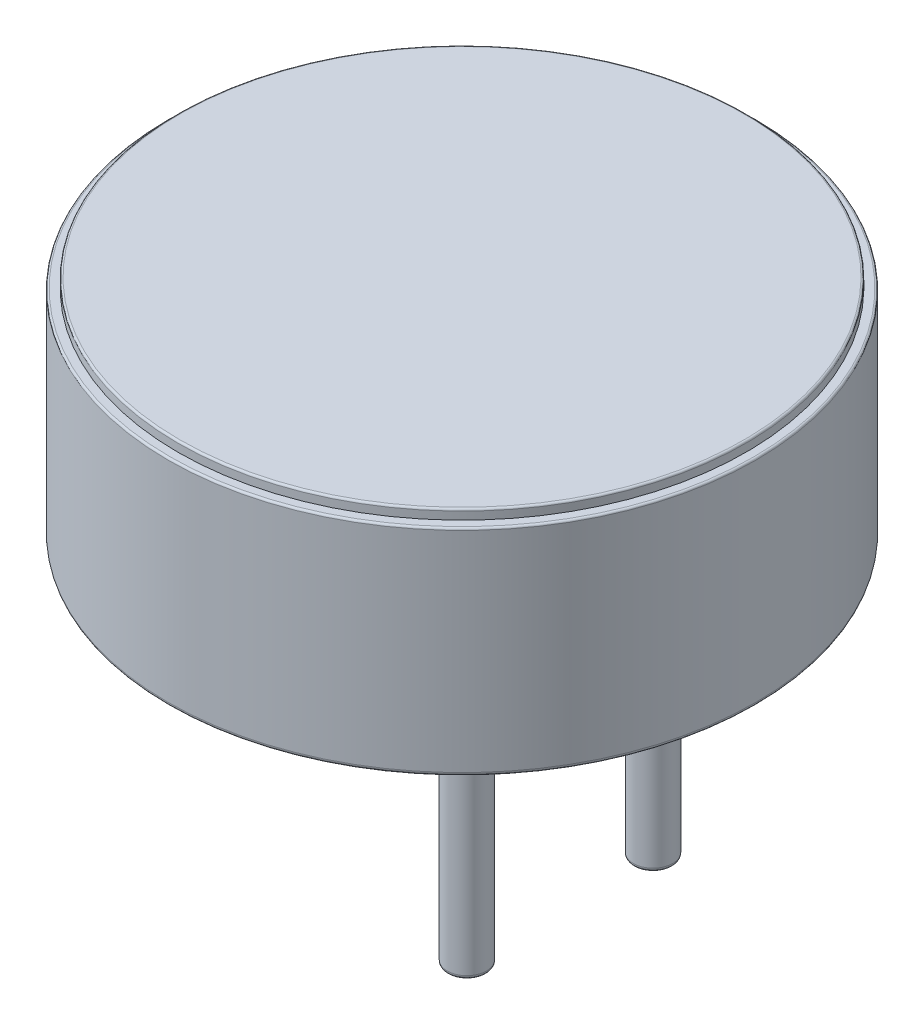
ISO-10303-21;
HEADER;
FILE_DESCRIPTION(('STEP AP214'),'2;1');
FILE_NAME('part.step','',(''),(''),'','','');
FILE_SCHEMA(('AUTOMOTIVE_DESIGN { 1 0 10303 214 1 1 1 1 }'));
ENDSEC;
DATA;
#1=APPLICATION_CONTEXT('core data for automotive mechanical design processes');
#2=APPLICATION_PROTOCOL_DEFINITION('international standard','automotive_design',2000,#1);
#3=PRODUCT_CONTEXT('',#1,'mechanical');
#4=PRODUCT('Part','Part','',(#3));
#5=PRODUCT_RELATED_PRODUCT_CATEGORY('part','',(#4));
#6=PRODUCT_DEFINITION_FORMATION('','',#4);
#7=PRODUCT_DEFINITION_CONTEXT('part definition',#1,'design');
#8=PRODUCT_DEFINITION('design','',#6,#7);
#9=PRODUCT_DEFINITION_SHAPE('','',#8);
#10=(LENGTH_UNIT() NAMED_UNIT(*) SI_UNIT(.MILLI.,.METRE.));
#11=(NAMED_UNIT(*) PLANE_ANGLE_UNIT() SI_UNIT($,.RADIAN.));
#12=(NAMED_UNIT(*) SI_UNIT($,.STERADIAN.) SOLID_ANGLE_UNIT());
#13=UNCERTAINTY_MEASURE_WITH_UNIT(LENGTH_MEASURE(1.E-05),#10,'distance_accuracy_value','');
#14=(GEOMETRIC_REPRESENTATION_CONTEXT(3) GLOBAL_UNCERTAINTY_ASSIGNED_CONTEXT((#13)) GLOBAL_UNIT_ASSIGNED_CONTEXT((#10,
#11,#12)) REPRESENTATION_CONTEXT('',''));
#15=CARTESIAN_POINT('',(0.,0.,0.));
#16=DIRECTION('',(0.,0.,1.));
#17=DIRECTION('',(1.,0.,0.));
#18=AXIS2_PLACEMENT_3D('',#15,#16,#17);
#19=CARTESIAN_POINT('',(0.999999999999999,-2.8,-0.95));
#20=DIRECTION('',(0.,1.,0.));
#21=DIRECTION('',(0.,0.,1.));
#22=AXIS2_PLACEMENT_3D('',#19,#20,#21);
#23=CYLINDRICAL_SURFACE('',#22,0.2);
#24=CARTESIAN_POINT('',(0.999999999999999,-2.76,-0.95));
#25=DIRECTION('',(0.,1.,0.));
#26=DIRECTION('',(0.,0.,1.));
#27=AXIS2_PLACEMENT_3D('',#24,#25,#26);
#28=CIRCLE('',#27,0.2);
#29=CARTESIAN_POINT('',(0.999999999999999,-2.76,-0.75));
#30=VERTEX_POINT('',#29);
#31=EDGE_CURVE('E13',#30,#30,#28,.T.);
#32=ORIENTED_EDGE('',*,*,#31,.T.);
#33=EDGE_LOOP('',(#32));
#34=FACE_BOUND('',#33,.T.);
#35=CARTESIAN_POINT('',(0.999999999999999,0.,-0.95));
#36=DIRECTION('',(0.,-1.,0.));
#37=DIRECTION('',(0.,0.,1.));
#38=AXIS2_PLACEMENT_3D('',#35,#36,#37);
#39=CIRCLE('',#38,0.2);
#40=CARTESIAN_POINT('',(0.999999999999999,0.,-0.75));
#41=VERTEX_POINT('',#40);
#42=EDGE_CURVE('E122',#41,#41,#39,.T.);
#43=ORIENTED_EDGE('',*,*,#42,.T.);
#44=EDGE_LOOP('',(#43));
#45=FACE_BOUND('',#44,.T.);
#46=ADVANCED_FACE('F108',(#34,#45),#23,.T.);
#47=CARTESIAN_POINT('',(0.999999999999999,-2.8,-0.95));
#48=DIRECTION('',(0.,1.,0.));
#49=DIRECTION('',(0.,0.,1.));
#50=AXIS2_PLACEMENT_3D('',#47,#48,#49);
#51=PLANE('',#50);
#52=CARTESIAN_POINT('',(0.999999999999999,-2.8,-0.95));
#53=DIRECTION('',(0.,1.,0.));
#54=DIRECTION('',(0.,0.,1.));
#55=AXIS2_PLACEMENT_3D('',#52,#53,#54);
#56=CIRCLE('',#55,0.16);
#57=CARTESIAN_POINT('',(0.999999999999999,-2.8,-0.79));
#58=VERTEX_POINT('',#57);
#59=EDGE_CURVE('E116',#58,#58,#56,.F.);
#60=ORIENTED_EDGE('',*,*,#59,.T.);
#61=EDGE_LOOP('',(#60));
#62=FACE_BOUND('',#61,.T.);
#63=ADVANCED_FACE('F132',(#62),#51,.F.);
#64=CARTESIAN_POINT('',(0.999999999999999,0.,-0.95));
#65=DIRECTION('',(0.,1.,0.));
#66=DIRECTION('',(0.,0.,1.));
#67=AXIS2_PLACEMENT_3D('',#64,#65,#66);
#68=PLANE('',#67);
#69=ORIENTED_EDGE('',*,*,#42,.F.);
#70=EDGE_LOOP('',(#69));
#71=FACE_BOUND('',#70,.T.);
#72=ADVANCED_FACE('F130',(#71),#68,.T.);
#73=CARTESIAN_POINT('',(0.999999999999999,-2.76,-0.95));
#74=DIRECTION('',(0.,1.,0.));
#75=DIRECTION('',(0.,0.,1.));
#76=AXIS2_PLACEMENT_3D('',#73,#74,#75);
#77=TOROIDAL_SURFACE('',#76,0.16,0.04);
#78=ORIENTED_EDGE('',*,*,#31,.F.);
#79=EDGE_LOOP('',(#78));
#80=FACE_BOUND('',#79,.T.);
#81=ORIENTED_EDGE('',*,*,#59,.F.);
#82=EDGE_LOOP('',(#81));
#83=FACE_BOUND('',#82,.T.);
#84=ADVANCED_FACE('F110',(#80,#83),#77,.T.);
#85=CLOSED_SHELL('',(#46,#63,#72,#84));
#86=MANIFOLD_SOLID_BREP('B2',#85);
#87=CARTESIAN_POINT('',(0.999999999999999,-2.8,0.95));
#88=DIRECTION('',(0.,1.,0.));
#89=DIRECTION('',(0.,0.,1.));
#90=AXIS2_PLACEMENT_3D('',#87,#88,#89);
#91=CYLINDRICAL_SURFACE('',#90,0.2);
#92=CARTESIAN_POINT('',(0.999999999999999,-2.76,0.95));
#93=DIRECTION('',(0.,-1.,0.));
#94=DIRECTION('',(0.,0.,-1.));
#95=AXIS2_PLACEMENT_3D('',#92,#93,#94);
#96=CIRCLE('',#95,0.2);
#97=CARTESIAN_POINT('',(0.999999999999999,-2.76,0.75));
#98=VERTEX_POINT('',#97);
#99=EDGE_CURVE('E107',#98,#98,#96,.F.);
#100=ORIENTED_EDGE('',*,*,#99,.T.);
#101=EDGE_LOOP('',(#100));
#102=FACE_BOUND('',#101,.T.);
#103=CARTESIAN_POINT('',(0.999999999999999,0.,0.95));
#104=DIRECTION('',(0.,-1.,0.));
#105=DIRECTION('',(0.,0.,-1.));
#106=AXIS2_PLACEMENT_3D('',#103,#104,#105);
#107=CIRCLE('',#106,0.2);
#108=CARTESIAN_POINT('',(0.999999999999999,0.,0.75));
#109=VERTEX_POINT('',#108);
#110=EDGE_CURVE('E192',#109,#109,#107,.T.);
#111=ORIENTED_EDGE('',*,*,#110,.T.);
#112=EDGE_LOOP('',(#111));
#113=FACE_BOUND('',#112,.T.);
#114=ADVANCED_FACE('F178',(#102,#113),#91,.T.);
#115=CARTESIAN_POINT('',(0.999999999999999,-2.8,0.95));
#116=DIRECTION('',(0.,-1.,0.));
#117=DIRECTION('',(0.,0.,-1.));
#118=AXIS2_PLACEMENT_3D('',#115,#116,#117);
#119=PLANE('',#118);
#120=CARTESIAN_POINT('',(0.999999999999999,-2.8,0.95));
#121=DIRECTION('',(0.,-1.,0.));
#122=DIRECTION('',(0.,0.,-1.));
#123=AXIS2_PLACEMENT_3D('',#120,#121,#122);
#124=CIRCLE('',#123,0.16);
#125=CARTESIAN_POINT('',(0.999999999999999,-2.8,0.79));
#126=VERTEX_POINT('',#125);
#127=EDGE_CURVE('E186',#126,#126,#124,.T.);
#128=ORIENTED_EDGE('',*,*,#127,.T.);
#129=EDGE_LOOP('',(#128));
#130=FACE_BOUND('',#129,.T.);
#131=ADVANCED_FACE('F202',(#130),#119,.T.);
#132=CARTESIAN_POINT('',(0.999999999999999,0.,0.95));
#133=DIRECTION('',(0.,-1.,0.));
#134=DIRECTION('',(0.,0.,-1.));
#135=AXIS2_PLACEMENT_3D('',#132,#133,#134);
#136=PLANE('',#135);
#137=ORIENTED_EDGE('',*,*,#110,.F.);
#138=EDGE_LOOP('',(#137));
#139=FACE_BOUND('',#138,.T.);
#140=ADVANCED_FACE('F200',(#139),#136,.F.);
#141=CARTESIAN_POINT('',(0.999999999999999,-2.76,0.95));
#142=DIRECTION('',(0.,-1.,0.));
#143=DIRECTION('',(0.,0.,-1.));
#144=AXIS2_PLACEMENT_3D('',#141,#142,#143);
#145=TOROIDAL_SURFACE('',#144,0.16,0.04);
#146=ORIENTED_EDGE('',*,*,#99,.F.);
#147=EDGE_LOOP('',(#146));
#148=FACE_BOUND('',#147,.T.);
#149=ORIENTED_EDGE('',*,*,#127,.F.);
#150=EDGE_LOOP('',(#149));
#151=FACE_BOUND('',#150,.T.);
#152=ADVANCED_FACE('F180',(#148,#151),#145,.T.);
#153=CLOSED_SHELL('',(#114,#131,#140,#152));
#154=MANIFOLD_SOLID_BREP('B8',#153);
#155=CARTESIAN_POINT('',(0.,2.3,0.));
#156=DIRECTION('',(0.,-1.,0.));
#157=DIRECTION('',(0.,0.,-1.));
#158=AXIS2_PLACEMENT_3D('',#155,#156,#157);
#159=CYLINDRICAL_SURFACE('',#158,2.9);
#160=CARTESIAN_POINT('',(0.,2.28,0.));
#161=DIRECTION('',(0.,1.,0.));
#162=DIRECTION('',(0.,0.,1.));
#163=AXIS2_PLACEMENT_3D('',#160,#161,#162);
#164=CIRCLE('',#163,2.9);
#165=CARTESIAN_POINT('',(0.,2.28,2.9));
#166=VERTEX_POINT('',#165);
#167=EDGE_CURVE('E177',#166,#166,#164,.F.);
#168=ORIENTED_EDGE('',*,*,#167,.T.);
#169=EDGE_LOOP('',(#168));
#170=FACE_BOUND('',#169,.T.);
#171=CARTESIAN_POINT('',(0.,2.2,0.));
#172=DIRECTION('',(0.,1.,0.));
#173=DIRECTION('',(0.,0.,1.));
#174=AXIS2_PLACEMENT_3D('',#171,#172,#173);
#175=CIRCLE('',#174,2.9);
#176=CARTESIAN_POINT('',(0.,2.2,2.9));
#177=VERTEX_POINT('',#176);
#178=EDGE_CURVE('E262',#177,#177,#175,.T.);
#179=ORIENTED_EDGE('',*,*,#178,.T.);
#180=EDGE_LOOP('',(#179));
#181=FACE_BOUND('',#180,.T.);
#182=ADVANCED_FACE('F249',(#170,#181),#159,.T.);
#183=CARTESIAN_POINT('',(0.,2.3,0.));
#184=DIRECTION('',(0.,1.,0.));
#185=DIRECTION('',(0.,0.,1.));
#186=AXIS2_PLACEMENT_3D('',#183,#184,#185);
#187=PLANE('',#186);
#188=CARTESIAN_POINT('',(0.,2.3,0.));
#189=DIRECTION('',(0.,1.,0.));
#190=DIRECTION('',(0.,0.,1.));
#191=AXIS2_PLACEMENT_3D('',#188,#189,#190);
#192=CIRCLE('',#191,2.88);
#193=CARTESIAN_POINT('',(0.,2.3,2.88));
#194=VERTEX_POINT('',#193);
#195=EDGE_CURVE('E257',#194,#194,#192,.T.);
#196=ORIENTED_EDGE('',*,*,#195,.T.);
#197=EDGE_LOOP('',(#196));
#198=FACE_BOUND('',#197,.T.);
#199=ADVANCED_FACE('F273',(#198),#187,.T.);
#200=CARTESIAN_POINT('',(0.,2.2,0.));
#201=DIRECTION('',(0.,1.,0.));
#202=DIRECTION('',(0.,0.,1.));
#203=AXIS2_PLACEMENT_3D('',#200,#201,#202);
#204=PLANE('',#203);
#205=ORIENTED_EDGE('',*,*,#178,.F.);
#206=EDGE_LOOP('',(#205));
#207=FACE_BOUND('',#206,.T.);
#208=ADVANCED_FACE('F271',(#207),#204,.F.);
#209=CARTESIAN_POINT('',(0.,2.28,0.));
#210=DIRECTION('',(0.,1.,0.));
#211=DIRECTION('',(0.,0.,1.));
#212=AXIS2_PLACEMENT_3D('',#209,#210,#211);
#213=TOROIDAL_SURFACE('',#212,2.88,0.02);
#214=ORIENTED_EDGE('',*,*,#167,.F.);
#215=EDGE_LOOP('',(#214));
#216=FACE_BOUND('',#215,.T.);
#217=ORIENTED_EDGE('',*,*,#195,.F.);
#218=EDGE_LOOP('',(#217));
#219=FACE_BOUND('',#218,.T.);
#220=ADVANCED_FACE('F251',(#216,#219),#213,.T.);
#221=CLOSED_SHELL('',(#182,#199,#208,#220));
#222=MANIFOLD_SOLID_BREP('B102',#221);
#223=CARTESIAN_POINT('',(0.,0.,0.));
#224=DIRECTION('',(0.,1.,0.));
#225=DIRECTION('',(0.,0.,1.));
#226=AXIS2_PLACEMENT_3D('',#223,#224,#225);
#227=PLANE('',#226);
#228=CARTESIAN_POINT('',(0.,0.,0.));
#229=DIRECTION('',(0.,1.,0.));
#230=DIRECTION('',(0.,0.,1.));
#231=AXIS2_PLACEMENT_3D('',#228,#229,#230);
#232=CIRCLE('',#231,2.96);
#233=CARTESIAN_POINT('',(0.,0.,2.96));
#234=VERTEX_POINT('',#233);
#235=EDGE_CURVE('E247',#234,#234,#232,.F.);
#236=ORIENTED_EDGE('',*,*,#235,.T.);
#237=EDGE_LOOP('',(#236));
#238=FACE_BOUND('',#237,.T.);
#239=DIRECTION('',(0.,0.,1.));
#240=VECTOR('',#239,1.);
#241=CARTESIAN_POINT('',(0.31905585155144,0.,0.962718477834421));
#242=LINE('',#241,#240);
#243=CARTESIAN_POINT('',(0.31905585155144,0.,0.896311748252225));
#244=VERTEX_POINT('',#243);
#245=CARTESIAN_POINT('',(0.31905585155144,0.,0.962718477834421));
#246=VERTEX_POINT('',#245);
#247=EDGE_CURVE('E445',#244,#246,#242,.T.);
#248=ORIENTED_EDGE('',*,*,#247,.F.);
#249=DIRECTION('',(1.,0.,0.));
#250=VECTOR('',#249,1.);
#251=CARTESIAN_POINT('',(0.0332033647910897,0.,0.896311748252225));
#252=LINE('',#251,#250);
#253=CARTESIAN_POINT('',(0.0332033647910897,0.,0.896311748252225));
#254=VERTEX_POINT('',#253);
#255=EDGE_CURVE('E327',#254,#244,#252,.T.);
#256=ORIENTED_EDGE('',*,*,#255,.F.);
#257=DIRECTION('',(0.,0.,1.));
#258=VECTOR('',#257,1.);
#259=CARTESIAN_POINT('',(0.0332033647910897,0.,0.896311748252225));
#260=LINE('',#259,#258);
#261=CARTESIAN_POINT('',(0.0332033647910889,0.,0.610459261491892));
#262=VERTEX_POINT('',#261);
#263=EDGE_CURVE('E481',#262,#254,#260,.T.);
#264=ORIENTED_EDGE('',*,*,#263,.F.);
#265=DIRECTION('',(1.,0.,0.));
#266=VECTOR('',#265,1.);
#267=CARTESIAN_POINT('',(0.0332033647910889,0.,0.610459261491892));
#268=LINE('',#267,#266);
#269=CARTESIAN_POINT('',(-0.0332033647911067,0.,0.610459261491893));
#270=VERTEX_POINT('',#269);
#271=EDGE_CURVE('E478',#270,#262,#268,.T.);
#272=ORIENTED_EDGE('',*,*,#271,.F.);
#273=DIRECTION('',(0.,0.,-1.));
#274=VECTOR('',#273,1.);
#275=CARTESIAN_POINT('',(-0.0332033647911058,0.,0.896311748252225));
#276=LINE('',#275,#274);
#277=CARTESIAN_POINT('',(-0.0332033647911058,0.,0.896311748252225));
#278=VERTEX_POINT('',#277);
#279=EDGE_CURVE('E411',#278,#270,#276,.T.);
#280=ORIENTED_EDGE('',*,*,#279,.F.);
#281=DIRECTION('',(1.,0.,0.));
#282=VECTOR('',#281,1.);
#283=CARTESIAN_POINT('',(-0.31905585155144,0.,0.896311748252225));
#284=LINE('',#283,#282);
#285=CARTESIAN_POINT('',(-0.31905585155144,0.,0.896311748252225));
#286=VERTEX_POINT('',#285);
#287=EDGE_CURVE('E472',#286,#278,#284,.T.);
#288=ORIENTED_EDGE('',*,*,#287,.F.);
#289=DIRECTION('',(0.,0.,-1.));
#290=VECTOR('',#289,1.);
#291=CARTESIAN_POINT('',(-0.31905585155144,0.,0.962718477834421));
#292=LINE('',#291,#290);
#293=CARTESIAN_POINT('',(-0.31905585155144,0.,0.962718477834421));
#294=VERTEX_POINT('',#293);
#295=EDGE_CURVE('E468',#294,#286,#292,.T.);
#296=ORIENTED_EDGE('',*,*,#295,.F.);
#297=DIRECTION('',(-1.,0.,0.));
#298=VECTOR('',#297,1.);
#299=CARTESIAN_POINT('',(-0.31905585155144,0.,0.962718477834421));
#300=LINE('',#299,#298);
#301=CARTESIAN_POINT('',(-0.0332033647911054,0.,0.962718477834421));
#302=VERTEX_POINT('',#301);
#303=EDGE_CURVE('E464',#302,#294,#300,.T.);
#304=ORIENTED_EDGE('',*,*,#303,.F.);
#305=DIRECTION('',(0.,0.,-1.));
#306=VECTOR('',#305,1.);
#307=CARTESIAN_POINT('',(-0.0332033647911045,0.,1.24857096459477));
#308=LINE('',#307,#306);
#309=CARTESIAN_POINT('',(-0.0332033647911045,0.,1.24857096459477));
#310=VERTEX_POINT('',#309);
#311=EDGE_CURVE('E460',#310,#302,#308,.T.);
#312=ORIENTED_EDGE('',*,*,#311,.F.);
#313=DIRECTION('',(-1.,0.,0.));
#314=VECTOR('',#313,1.);
#315=CARTESIAN_POINT('',(0.0332033647910911,0.,1.24857096459477));
#316=LINE('',#315,#314);
#317=CARTESIAN_POINT('',(0.0332033647910911,0.,1.24857096459477));
#318=VERTEX_POINT('',#317);
#319=EDGE_CURVE('E457',#318,#310,#316,.T.);
#320=ORIENTED_EDGE('',*,*,#319,.F.);
#321=DIRECTION('',(0.,0.,1.));
#322=VECTOR('',#321,1.);
#323=CARTESIAN_POINT('',(0.0332033647910911,0.,1.24857096459477));
#324=LINE('',#323,#322);
#325=CARTESIAN_POINT('',(0.0332033647910901,0.,0.962718477834421));
#326=VERTEX_POINT('',#325);
#327=EDGE_CURVE('E453',#326,#318,#324,.T.);
#328=ORIENTED_EDGE('',*,*,#327,.F.);
#329=DIRECTION('',(-1.,0.,0.));
#330=VECTOR('',#329,1.);
#331=CARTESIAN_POINT('',(0.0332033647910901,0.,0.962718477834421));
#332=LINE('',#331,#330);
#333=EDGE_CURVE('E449',#246,#326,#332,.T.);
#334=ORIENTED_EDGE('',*,*,#333,.F.);
#335=EDGE_LOOP('',(#248,#256,#264,#272,#280,#288,#296,#304,#312,#320,#328,#334));
#336=FACE_BOUND('',#335,.T.);
#337=CARTESIAN_POINT('',(1.41540421290184,0.,0.95));
#338=CARTESIAN_POINT('',(1.41540421290184,0.,0.895631032932585));
#339=CARTESIAN_POINT('',(1.39377489299911,0.,0.786893098797756));
#340=CARTESIAN_POINT('',(1.30138225526419,0.,0.648617744735812));
#341=CARTESIAN_POINT('',(1.16310690120224,0.,0.556225107000893));
#342=CARTESIAN_POINT('',(0.999999999999999,0.,0.523781127146795));
#343=CARTESIAN_POINT('',(0.836893098797755,0.,0.556225107000893));
#344=CARTESIAN_POINT('',(0.698617744735811,0.,0.648617744735812));
#345=CARTESIAN_POINT('',(0.606225107000892,0.,0.786893098797756));
#346=CARTESIAN_POINT('',(0.573781127146794,0.,0.95));
#347=CARTESIAN_POINT('',(0.606225107000893,0.,1.11310690120224));
#348=CARTESIAN_POINT('',(0.698617744735811,0.,1.25138225526419));
#349=CARTESIAN_POINT('',(0.836893098797755,0.,1.34377489299911));
#350=CARTESIAN_POINT('',(0.999999999999999,0.,1.37621887285321));
#351=CARTESIAN_POINT('',(1.16310690120224,0.,1.34377489299911));
#352=CARTESIAN_POINT('',(1.30138225526419,0.,1.25138225526419));
#353=CARTESIAN_POINT('',(1.39377489299911,0.,1.11310690120224));
#354=CARTESIAN_POINT('',(1.41540421290184,0.,1.00436896706742));
#355=CARTESIAN_POINT('',(1.41540421290184,0.,0.95));
#356=B_SPLINE_CURVE_WITH_KNOTS('',3,(#337,#338,#339,#340,#341,#342,#343,#344,#345,#346,#347,
#348,#349,#350,#351,#352,#353,#354,#355),.UNSPECIFIED.,.T.,.F.,(4,1,1,1,1,1,1,1,1,1,1,1,1,1,1,1,
4),(0.,0.0625000000000002,0.125,0.1875,0.25,0.3125,0.375,0.4375,0.5,0.5625,0.625,0.6875,0.75,
0.8125,0.875,0.9375,1.),.UNSPECIFIED.);
#357=CARTESIAN_POINT('',(1.41540421290184,0.,0.95));
#358=VERTEX_POINT('',#357);
#359=EDGE_CURVE('E487',#358,#358,#356,.T.);
#360=ORIENTED_EDGE('',*,*,#359,.T.);
#361=EDGE_LOOP('',(#360));
#362=FACE_BOUND('',#361,.T.);
#363=ADVANCED_FACE('F311',(#238,#336,#362),#227,.F.);
#364=CARTESIAN_POINT('',(0.,2.2,0.));
#365=DIRECTION('',(0.,-1.,0.));
#366=DIRECTION('',(0.,0.,-1.));
#367=AXIS2_PLACEMENT_3D('',#364,#365,#366);
#368=CYLINDRICAL_SURFACE('',#367,3.);
#369=CARTESIAN_POINT('',(0.,0.0400000000000001,0.));
#370=DIRECTION('',(0.,1.,0.));
#371=DIRECTION('',(0.,0.,1.));
#372=AXIS2_PLACEMENT_3D('',#369,#370,#371);
#373=CIRCLE('',#372,3.);
#374=CARTESIAN_POINT('',(0.,0.0400000000000001,3.));
#375=VERTEX_POINT('',#374);
#376=EDGE_CURVE('E320',#375,#375,#373,.T.);
#377=ORIENTED_EDGE('',*,*,#376,.T.);
#378=EDGE_LOOP('',(#377));
#379=FACE_BOUND('',#378,.T.);
#380=CARTESIAN_POINT('',(0.,2.18,0.));
#381=DIRECTION('',(0.,1.,0.));
#382=DIRECTION('',(0.,0.,1.));
#383=AXIS2_PLACEMENT_3D('',#380,#381,#382);
#384=CIRCLE('',#383,3.);
#385=CARTESIAN_POINT('',(0.,2.18,3.));
#386=VERTEX_POINT('',#385);
#387=EDGE_CURVE('E527',#386,#386,#384,.F.);
#388=ORIENTED_EDGE('',*,*,#387,.T.);
#389=EDGE_LOOP('',(#388));
#390=FACE_BOUND('',#389,.T.);
#391=ADVANCED_FACE('F534',(#379,#390),#368,.T.);
#392=CARTESIAN_POINT('',(0.,2.2,0.));
#393=DIRECTION('',(0.,1.,0.));
#394=DIRECTION('',(0.,0.,1.));
#395=AXIS2_PLACEMENT_3D('',#392,#393,#394);
#396=PLANE('',#395);
#397=CARTESIAN_POINT('',(0.,2.2,0.));
#398=DIRECTION('',(0.,1.,0.));
#399=DIRECTION('',(0.,0.,1.));
#400=AXIS2_PLACEMENT_3D('',#397,#398,#399);
#401=CIRCLE('',#400,2.98);
#402=CARTESIAN_POINT('',(0.,2.2,2.98));
#403=VERTEX_POINT('',#402);
#404=EDGE_CURVE('E520',#403,#403,#401,.T.);
#405=ORIENTED_EDGE('',*,*,#404,.T.);
#406=EDGE_LOOP('',(#405));
#407=FACE_BOUND('',#406,.T.);
#408=ADVANCED_FACE('F552',(#407),#396,.T.);
#409=ORIENTED_EDGE('',*,*,#359,.F.);
#410=EDGE_LOOP('',(#409));
#411=FACE_BOUND('',#410,.T.);
#412=ADVANCED_FACE('F548',(#411),#227,.F.);
#413=CARTESIAN_POINT('',(0.0332033647910897,0.01,0.896311748252225));
#414=DIRECTION('',(0.,0.,-1.));
#415=DIRECTION('',(-1.,0.,0.));
#416=AXIS2_PLACEMENT_3D('',#413,#414,#415);
#417=PLANE('',#416);
#418=ORIENTED_EDGE('',*,*,#255,.T.);
#419=DIRECTION('',(0.,-1.,0.));
#420=VECTOR('',#419,1.);
#421=CARTESIAN_POINT('',(0.31905585155144,0.01,0.896311748252225));
#422=LINE('',#421,#420);
#423=CARTESIAN_POINT('',(0.31905585155144,0.01,0.896311748252225));
#424=VERTEX_POINT('',#423);
#425=EDGE_CURVE('E375',#424,#244,#422,.T.);
#426=ORIENTED_EDGE('',*,*,#425,.F.);
#427=DIRECTION('',(1.,0.,0.));
#428=VECTOR('',#427,1.);
#429=CARTESIAN_POINT('',(0.0332033647910897,0.01,0.896311748252225));
#430=LINE('',#429,#428);
#431=CARTESIAN_POINT('',(0.0332033647910897,0.01,0.896311748252225));
#432=VERTEX_POINT('',#431);
#433=EDGE_CURVE('E484',#432,#424,#430,.T.);
#434=ORIENTED_EDGE('',*,*,#433,.F.);
#435=DIRECTION('',(0.,-1.,0.));
#436=VECTOR('',#435,1.);
#437=CARTESIAN_POINT('',(0.0332033647910897,0.01,0.896311748252225));
#438=LINE('',#437,#436);
#439=EDGE_CURVE('E335',#432,#254,#438,.T.);
#440=ORIENTED_EDGE('',*,*,#439,.T.);
#441=EDGE_LOOP('',(#418,#426,#434,#440));
#442=FACE_BOUND('',#441,.T.);
#443=ADVANCED_FACE('F557',(#442),#417,.F.);
#444=CARTESIAN_POINT('',(0.0332033647910897,0.01,0.896311748252225));
#445=DIRECTION('',(1.,0.,0.));
#446=DIRECTION('',(0.,0.,-1.));
#447=AXIS2_PLACEMENT_3D('',#444,#445,#446);
#448=PLANE('',#447);
#449=ORIENTED_EDGE('',*,*,#263,.T.);
#450=ORIENTED_EDGE('',*,*,#439,.F.);
#451=DIRECTION('',(0.,0.,1.));
#452=VECTOR('',#451,1.);
#453=CARTESIAN_POINT('',(0.0332033647910897,0.01,0.896311748252225));
#454=LINE('',#453,#452);
#455=CARTESIAN_POINT('',(0.0332033647910889,0.01,0.610459261491892));
#456=VERTEX_POINT('',#455);
#457=EDGE_CURVE('E425',#456,#432,#454,.T.);
#458=ORIENTED_EDGE('',*,*,#457,.F.);
#459=DIRECTION('',(0.,-1.,0.));
#460=VECTOR('',#459,1.);
#461=CARTESIAN_POINT('',(0.0332033647910889,0.01,0.610459261491892));
#462=LINE('',#461,#460);
#463=EDGE_CURVE('E416',#456,#262,#462,.T.);
#464=ORIENTED_EDGE('',*,*,#463,.T.);
#465=EDGE_LOOP('',(#449,#450,#458,#464));
#466=FACE_BOUND('',#465,.T.);
#467=ADVANCED_FACE('F563',(#466),#448,.F.);
#468=CARTESIAN_POINT('',(0.0332033647910889,0.01,0.610459261491892));
#469=DIRECTION('',(0.,0.,-1.));
#470=DIRECTION('',(-1.,0.,0.));
#471=AXIS2_PLACEMENT_3D('',#468,#469,#470);
#472=PLANE('',#471);
#473=ORIENTED_EDGE('',*,*,#271,.T.);
#474=ORIENTED_EDGE('',*,*,#463,.F.);
#475=DIRECTION('',(1.,0.,0.));
#476=VECTOR('',#475,1.);
#477=CARTESIAN_POINT('',(0.0332033647910889,0.01,0.610459261491892));
#478=LINE('',#477,#476);
#479=CARTESIAN_POINT('',(-0.0332033647911067,0.01,0.610459261491893));
#480=VERTEX_POINT('',#479);
#481=EDGE_CURVE('E420',#480,#456,#478,.T.);
#482=ORIENTED_EDGE('',*,*,#481,.F.);
#483=DIRECTION('',(0.,-1.,0.));
#484=VECTOR('',#483,1.);
#485=CARTESIAN_POINT('',(-0.0332033647911067,0.01,0.610459261491893));
#486=LINE('',#485,#484);
#487=EDGE_CURVE('E404',#480,#270,#486,.T.);
#488=ORIENTED_EDGE('',*,*,#487,.T.);
#489=EDGE_LOOP('',(#473,#474,#482,#488));
#490=FACE_BOUND('',#489,.T.);
#491=ADVANCED_FACE('F421',(#490),#472,.F.);
#492=CARTESIAN_POINT('',(-0.0332033647911058,0.01,0.896311748252225));
#493=DIRECTION('',(-1.,0.,0.));
#494=DIRECTION('',(0.,0.,1.));
#495=AXIS2_PLACEMENT_3D('',#492,#493,#494);
#496=PLANE('',#495);
#497=ORIENTED_EDGE('',*,*,#279,.T.);
#498=ORIENTED_EDGE('',*,*,#487,.F.);
#499=DIRECTION('',(0.,0.,-1.));
#500=VECTOR('',#499,1.);
#501=CARTESIAN_POINT('',(-0.0332033647911058,0.01,0.896311748252225));
#502=LINE('',#501,#500);
#503=CARTESIAN_POINT('',(-0.0332033647911058,0.01,0.896311748252225));
#504=VERTEX_POINT('',#503);
#505=EDGE_CURVE('E408',#504,#480,#502,.T.);
#506=ORIENTED_EDGE('',*,*,#505,.F.);
#507=DIRECTION('',(0.,-1.,0.));
#508=VECTOR('',#507,1.);
#509=CARTESIAN_POINT('',(-0.0332033647911058,0.01,0.896311748252225));
#510=LINE('',#509,#508);
#511=EDGE_CURVE('E417',#504,#278,#510,.T.);
#512=ORIENTED_EDGE('',*,*,#511,.T.);
#513=EDGE_LOOP('',(#497,#498,#506,#512));
#514=FACE_BOUND('',#513,.T.);
#515=ADVANCED_FACE('F406',(#514),#496,.F.);
#516=CARTESIAN_POINT('',(-0.31905585155144,0.01,0.896311748252225));
#517=DIRECTION('',(0.,0.,-1.));
#518=DIRECTION('',(-1.,0.,0.));
#519=AXIS2_PLACEMENT_3D('',#516,#517,#518);
#520=PLANE('',#519);
#521=ORIENTED_EDGE('',*,*,#287,.T.);
#522=ORIENTED_EDGE('',*,*,#511,.F.);
#523=DIRECTION('',(1.,0.,0.));
#524=VECTOR('',#523,1.);
#525=CARTESIAN_POINT('',(-0.31905585155144,0.01,0.896311748252225));
#526=LINE('',#525,#524);
#527=CARTESIAN_POINT('',(-0.31905585155144,0.01,0.896311748252225));
#528=VERTEX_POINT('',#527);
#529=EDGE_CURVE('E431',#528,#504,#526,.T.);
#530=ORIENTED_EDGE('',*,*,#529,.F.);
#531=DIRECTION('',(0.,-1.,0.));
#532=VECTOR('',#531,1.);
#533=CARTESIAN_POINT('',(-0.31905585155144,0.01,0.896311748252225));
#534=LINE('',#533,#532);
#535=EDGE_CURVE('E492',#528,#286,#534,.T.);
#536=ORIENTED_EDGE('',*,*,#535,.T.);
#537=EDGE_LOOP('',(#521,#522,#530,#536));
#538=FACE_BOUND('',#537,.T.);
#539=ADVANCED_FACE('F598',(#538),#520,.F.);
#540=CARTESIAN_POINT('',(-0.31905585155144,0.01,0.962718477834421));
#541=DIRECTION('',(-1.,0.,0.));
#542=DIRECTION('',(0.,0.,1.));
#543=AXIS2_PLACEMENT_3D('',#540,#541,#542);
#544=PLANE('',#543);
#545=ORIENTED_EDGE('',*,*,#295,.T.);
#546=ORIENTED_EDGE('',*,*,#535,.F.);
#547=DIRECTION('',(0.,0.,-1.));
#548=VECTOR('',#547,1.);
#549=CARTESIAN_POINT('',(-0.31905585155144,0.01,0.962718477834421));
#550=LINE('',#549,#548);
#551=CARTESIAN_POINT('',(-0.31905585155144,0.01,0.962718477834421));
#552=VERTEX_POINT('',#551);
#553=EDGE_CURVE('E437',#552,#528,#550,.T.);
#554=ORIENTED_EDGE('',*,*,#553,.F.);
#555=DIRECTION('',(0.,-1.,0.));
#556=VECTOR('',#555,1.);
#557=CARTESIAN_POINT('',(-0.31905585155144,0.01,0.962718477834421));
#558=LINE('',#557,#556);
#559=EDGE_CURVE('E495',#552,#294,#558,.T.);
#560=ORIENTED_EDGE('',*,*,#559,.T.);
#561=EDGE_LOOP('',(#545,#546,#554,#560));
#562=FACE_BOUND('',#561,.T.);
#563=ADVANCED_FACE('F594',(#562),#544,.F.);
#564=CARTESIAN_POINT('',(-0.31905585155144,0.01,0.962718477834421));
#565=DIRECTION('',(0.,0.,1.));
#566=DIRECTION('',(1.,0.,0.));
#567=AXIS2_PLACEMENT_3D('',#564,#565,#566);
#568=PLANE('',#567);
#569=ORIENTED_EDGE('',*,*,#303,.T.);
#570=ORIENTED_EDGE('',*,*,#559,.F.);
#571=DIRECTION('',(-1.,0.,0.));
#572=VECTOR('',#571,1.);
#573=CARTESIAN_POINT('',(-0.31905585155144,0.01,0.962718477834421));
#574=LINE('',#573,#572);
#575=CARTESIAN_POINT('',(-0.0332033647911054,0.01,0.962718477834421));
#576=VERTEX_POINT('',#575);
#577=EDGE_CURVE('E766',#576,#552,#574,.T.);
#578=ORIENTED_EDGE('',*,*,#577,.F.);
#579=DIRECTION('',(0.,-1.,0.));
#580=VECTOR('',#579,1.);
#581=CARTESIAN_POINT('',(-0.0332033647911054,0.01,0.962718477834421));
#582=LINE('',#581,#580);
#583=EDGE_CURVE('E498',#576,#302,#582,.T.);
#584=ORIENTED_EDGE('',*,*,#583,.T.);
#585=EDGE_LOOP('',(#569,#570,#578,#584));
#586=FACE_BOUND('',#585,.T.);
#587=ADVANCED_FACE('F590',(#586),#568,.F.);
#588=CARTESIAN_POINT('',(-0.0332033647911045,0.01,1.24857096459477));
#589=DIRECTION('',(-1.,0.,0.));
#590=DIRECTION('',(0.,0.,1.));
#591=AXIS2_PLACEMENT_3D('',#588,#589,#590);
#592=PLANE('',#591);
#593=ORIENTED_EDGE('',*,*,#311,.T.);
#594=ORIENTED_EDGE('',*,*,#583,.F.);
#595=DIRECTION('',(0.,0.,-1.));
#596=VECTOR('',#595,1.);
#597=CARTESIAN_POINT('',(-0.0332033647911045,0.01,1.24857096459477));
#598=LINE('',#597,#596);
#599=CARTESIAN_POINT('',(-0.0332033647911045,0.01,1.24857096459477));
#600=VERTEX_POINT('',#599);
#601=EDGE_CURVE('E762',#600,#576,#598,.T.);
#602=ORIENTED_EDGE('',*,*,#601,.F.);
#603=DIRECTION('',(0.,-1.,0.));
#604=VECTOR('',#603,1.);
#605=CARTESIAN_POINT('',(-0.0332033647911045,0.01,1.24857096459477));
#606=LINE('',#605,#604);
#607=EDGE_CURVE('E501',#600,#310,#606,.T.);
#608=ORIENTED_EDGE('',*,*,#607,.T.);
#609=EDGE_LOOP('',(#593,#594,#602,#608));
#610=FACE_BOUND('',#609,.T.);
#611=ADVANCED_FACE('F586',(#610),#592,.F.);
#612=CARTESIAN_POINT('',(0.0332033647910911,0.01,1.24857096459477));
#613=DIRECTION('',(0.,0.,1.));
#614=DIRECTION('',(1.,0.,0.));
#615=AXIS2_PLACEMENT_3D('',#612,#613,#614);
#616=PLANE('',#615);
#617=ORIENTED_EDGE('',*,*,#319,.T.);
#618=ORIENTED_EDGE('',*,*,#607,.F.);
#619=DIRECTION('',(-1.,0.,0.));
#620=VECTOR('',#619,1.);
#621=CARTESIAN_POINT('',(0.0332033647910911,0.01,1.24857096459477));
#622=LINE('',#621,#620);
#623=CARTESIAN_POINT('',(0.0332033647910911,0.01,1.24857096459477));
#624=VERTEX_POINT('',#623);
#625=EDGE_CURVE('E758',#624,#600,#622,.T.);
#626=ORIENTED_EDGE('',*,*,#625,.F.);
#627=DIRECTION('',(0.,-1.,0.));
#628=VECTOR('',#627,1.);
#629=CARTESIAN_POINT('',(0.0332033647910911,0.01,1.24857096459477));
#630=LINE('',#629,#628);
#631=EDGE_CURVE('E504',#624,#318,#630,.T.);
#632=ORIENTED_EDGE('',*,*,#631,.T.);
#633=EDGE_LOOP('',(#617,#618,#626,#632));
#634=FACE_BOUND('',#633,.T.);
#635=ADVANCED_FACE('F582',(#634),#616,.F.);
#636=CARTESIAN_POINT('',(0.0332033647910911,0.01,1.24857096459477));
#637=DIRECTION('',(1.,0.,0.));
#638=DIRECTION('',(0.,0.,-1.));
#639=AXIS2_PLACEMENT_3D('',#636,#637,#638);
#640=PLANE('',#639);
#641=ORIENTED_EDGE('',*,*,#327,.T.);
#642=ORIENTED_EDGE('',*,*,#631,.F.);
#643=DIRECTION('',(0.,0.,1.));
#644=VECTOR('',#643,1.);
#645=CARTESIAN_POINT('',(0.0332033647910911,0.01,1.24857096459477));
#646=LINE('',#645,#644);
#647=CARTESIAN_POINT('',(0.0332033647910901,0.01,0.962718477834421));
#648=VERTEX_POINT('',#647);
#649=EDGE_CURVE('E754',#648,#624,#646,.T.);
#650=ORIENTED_EDGE('',*,*,#649,.F.);
#651=DIRECTION('',(0.,-1.,0.));
#652=VECTOR('',#651,1.);
#653=CARTESIAN_POINT('',(0.0332033647910901,0.01,0.962718477834421));
#654=LINE('',#653,#652);
#655=EDGE_CURVE('E507',#648,#326,#654,.T.);
#656=ORIENTED_EDGE('',*,*,#655,.T.);
#657=EDGE_LOOP('',(#641,#642,#650,#656));
#658=FACE_BOUND('',#657,.T.);
#659=ADVANCED_FACE('F578',(#658),#640,.F.);
#660=CARTESIAN_POINT('',(0.0332033647910901,0.01,0.962718477834421));
#661=DIRECTION('',(0.,0.,1.));
#662=DIRECTION('',(1.,0.,0.));
#663=AXIS2_PLACEMENT_3D('',#660,#661,#662);
#664=PLANE('',#663);
#665=ORIENTED_EDGE('',*,*,#333,.T.);
#666=ORIENTED_EDGE('',*,*,#655,.F.);
#667=DIRECTION('',(-1.,0.,0.));
#668=VECTOR('',#667,1.);
#669=CARTESIAN_POINT('',(0.0332033647910901,0.01,0.962718477834421));
#670=LINE('',#669,#668);
#671=CARTESIAN_POINT('',(0.31905585155144,0.01,0.962718477834421));
#672=VERTEX_POINT('',#671);
#673=EDGE_CURVE('E748',#672,#648,#670,.T.);
#674=ORIENTED_EDGE('',*,*,#673,.F.);
#675=DIRECTION('',(0.,-1.,0.));
#676=VECTOR('',#675,1.);
#677=CARTESIAN_POINT('',(0.31905585155144,0.01,0.962718477834421));
#678=LINE('',#677,#676);
#679=EDGE_CURVE('E510',#672,#246,#678,.T.);
#680=ORIENTED_EDGE('',*,*,#679,.T.);
#681=EDGE_LOOP('',(#665,#666,#674,#680));
#682=FACE_BOUND('',#681,.T.);
#683=ADVANCED_FACE('F574',(#682),#664,.F.);
#684=CARTESIAN_POINT('',(0.31905585155144,0.01,0.962718477834421));
#685=DIRECTION('',(1.,0.,0.));
#686=DIRECTION('',(0.,0.,-1.));
#687=AXIS2_PLACEMENT_3D('',#684,#685,#686);
#688=PLANE('',#687);
#689=ORIENTED_EDGE('',*,*,#247,.T.);
#690=ORIENTED_EDGE('',*,*,#679,.F.);
#691=DIRECTION('',(0.,0.,1.));
#692=VECTOR('',#691,1.);
#693=CARTESIAN_POINT('',(0.31905585155144,0.01,0.962718477834421));
#694=LINE('',#693,#692);
#695=EDGE_CURVE('E745',#424,#672,#694,.T.);
#696=ORIENTED_EDGE('',*,*,#695,.F.);
#697=ORIENTED_EDGE('',*,*,#425,.T.);
#698=EDGE_LOOP('',(#689,#690,#696,#697));
#699=FACE_BOUND('',#698,.T.);
#700=ADVANCED_FACE('F571',(#699),#688,.F.);
#701=CARTESIAN_POINT('',(0.,0.01,0.));
#702=DIRECTION('',(0.,1.,0.));
#703=DIRECTION('',(0.,0.,1.));
#704=AXIS2_PLACEMENT_3D('',#701,#702,#703);
#705=PLANE('',#704);
#706=ORIENTED_EDGE('',*,*,#433,.T.);
#707=ORIENTED_EDGE('',*,*,#695,.T.);
#708=ORIENTED_EDGE('',*,*,#673,.T.);
#709=ORIENTED_EDGE('',*,*,#649,.T.);
#710=ORIENTED_EDGE('',*,*,#625,.T.);
#711=ORIENTED_EDGE('',*,*,#601,.T.);
#712=ORIENTED_EDGE('',*,*,#577,.T.);
#713=ORIENTED_EDGE('',*,*,#553,.T.);
#714=ORIENTED_EDGE('',*,*,#529,.T.);
#715=ORIENTED_EDGE('',*,*,#505,.T.);
#716=ORIENTED_EDGE('',*,*,#481,.T.);
#717=ORIENTED_EDGE('',*,*,#457,.T.);
#718=EDGE_LOOP('',(#706,#707,#708,#709,#710,#711,#712,#713,#714,#715,#716,#717));
#719=FACE_BOUND('',#718,.T.);
#720=ADVANCED_FACE('F428',(#719),#705,.F.);
#721=CARTESIAN_POINT('',(0.,2.18,0.));
#722=DIRECTION('',(0.,1.,0.));
#723=DIRECTION('',(0.,0.,1.));
#724=AXIS2_PLACEMENT_3D('',#721,#722,#723);
#725=TOROIDAL_SURFACE('',#724,2.98,0.02);
#726=ORIENTED_EDGE('',*,*,#387,.F.);
#727=EDGE_LOOP('',(#726));
#728=FACE_BOUND('',#727,.T.);
#729=ORIENTED_EDGE('',*,*,#404,.F.);
#730=EDGE_LOOP('',(#729));
#731=FACE_BOUND('',#730,.T.);
#732=ADVANCED_FACE('F538',(#728,#731),#725,.T.);
#733=CARTESIAN_POINT('',(0.,0.0400000000000001,0.));
#734=DIRECTION('',(0.,1.,0.));
#735=DIRECTION('',(0.,0.,1.));
#736=AXIS2_PLACEMENT_3D('',#733,#734,#735);
#737=TOROIDAL_SURFACE('',#736,2.96,0.04);
#738=ORIENTED_EDGE('',*,*,#235,.F.);
#739=EDGE_LOOP('',(#738));
#740=FACE_BOUND('',#739,.T.);
#741=ORIENTED_EDGE('',*,*,#376,.F.);
#742=EDGE_LOOP('',(#741));
#743=FACE_BOUND('',#742,.T.);
#744=ADVANCED_FACE('F313',(#740,#743),#737,.T.);
#745=CLOSED_SHELL('',(#363,#391,#408,#412,#443,#467,#491,#515,#539,#563,#587,#611,#635,#659,
#683,#700,#720,#732,#744));
#746=MANIFOLD_SOLID_BREP('B172',#745);
#747=ADVANCED_BREP_SHAPE_REPRESENTATION('',(#18,#86,#154,#222,#746),#14);
#748=SHAPE_DEFINITION_REPRESENTATION(#9,#747);
ENDSEC;
END-ISO-10303-21;
